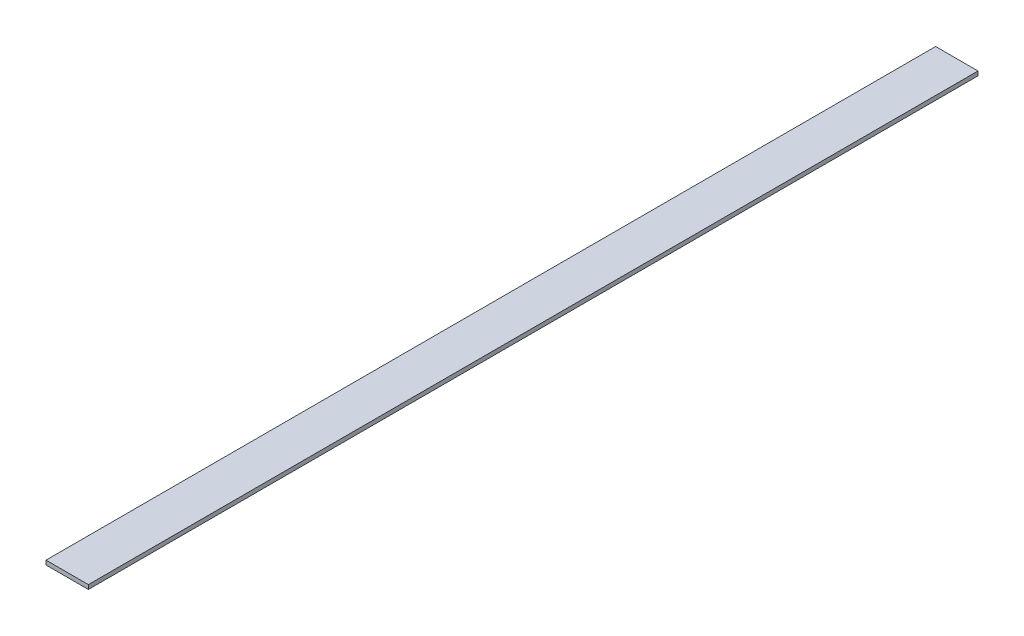
ISO-10303-21;
HEADER;
FILE_DESCRIPTION(('STEP AP214'),'2;1');
FILE_NAME('part.step','',(''),(''),'','','');
FILE_SCHEMA(('AUTOMOTIVE_DESIGN { 1 0 10303 214 1 1 1 1 }'));
ENDSEC;
DATA;
#1=APPLICATION_CONTEXT('core data for automotive mechanical design processes');
#2=APPLICATION_PROTOCOL_DEFINITION('international standard','automotive_design',2000,#1);
#3=PRODUCT_CONTEXT('',#1,'mechanical');
#4=PRODUCT('Part','Part','',(#3));
#5=PRODUCT_RELATED_PRODUCT_CATEGORY('part','',(#4));
#6=PRODUCT_DEFINITION_FORMATION('','',#4);
#7=PRODUCT_DEFINITION_CONTEXT('part definition',#1,'design');
#8=PRODUCT_DEFINITION('design','',#6,#7);
#9=PRODUCT_DEFINITION_SHAPE('','',#8);
#10=(LENGTH_UNIT() NAMED_UNIT(*) SI_UNIT(.MILLI.,.METRE.));
#11=(NAMED_UNIT(*) PLANE_ANGLE_UNIT() SI_UNIT($,.RADIAN.));
#12=(NAMED_UNIT(*) SI_UNIT($,.STERADIAN.) SOLID_ANGLE_UNIT());
#13=UNCERTAINTY_MEASURE_WITH_UNIT(LENGTH_MEASURE(1.E-05),#10,'distance_accuracy_value','');
#14=(GEOMETRIC_REPRESENTATION_CONTEXT(3) GLOBAL_UNCERTAINTY_ASSIGNED_CONTEXT((#13)) GLOBAL_UNIT_ASSIGNED_CONTEXT((#10,
#11,#12)) REPRESENTATION_CONTEXT('',''));
#15=CARTESIAN_POINT('',(0.,0.,0.));
#16=DIRECTION('',(0.,0.,1.));
#17=DIRECTION('',(1.,0.,0.));
#18=AXIS2_PLACEMENT_3D('',#15,#16,#17);
#19=CARTESIAN_POINT('',(-50.7999999999998,5.08,0.));
#20=DIRECTION('',(0.,0.,-1.));
#21=DIRECTION('',(-1.,0.,0.));
#22=AXIS2_PLACEMENT_3D('',#19,#20,#21);
#23=PLANE('',#22);
#24=DIRECTION('',(1.,0.,0.));
#25=VECTOR('',#24,1.);
#26=CARTESIAN_POINT('',(-50.7999999999998,0.,0.));
#27=LINE('',#26,#25);
#28=CARTESIAN_POINT('',(-50.7999999999998,0.,0.));
#29=VERTEX_POINT('',#28);
#30=CARTESIAN_POINT('',(0.,0.,0.));
#31=VERTEX_POINT('',#30);
#32=EDGE_CURVE('E111',#29,#31,#27,.T.);
#33=ORIENTED_EDGE('',*,*,#32,.T.);
#34=DIRECTION('',(0.,-1.,0.));
#35=VECTOR('',#34,1.);
#36=CARTESIAN_POINT('',(0.,5.08,0.));
#37=LINE('',#36,#35);
#38=CARTESIAN_POINT('',(0.,5.08,0.));
#39=VERTEX_POINT('',#38);
#40=EDGE_CURVE('E11',#39,#31,#37,.T.);
#41=ORIENTED_EDGE('',*,*,#40,.F.);
#42=DIRECTION('',(1.,0.,0.));
#43=VECTOR('',#42,1.);
#44=CARTESIAN_POINT('',(-50.7999999999998,5.08,0.));
#45=LINE('',#44,#43);
#46=CARTESIAN_POINT('',(-50.7999999999998,5.08,0.));
#47=VERTEX_POINT('',#46);
#48=EDGE_CURVE('E93',#47,#39,#45,.T.);
#49=ORIENTED_EDGE('',*,*,#48,.F.);
#50=DIRECTION('',(0.,-1.,0.));
#51=VECTOR('',#50,1.);
#52=CARTESIAN_POINT('',(-50.7999999999998,5.08,0.));
#53=LINE('',#52,#51);
#54=EDGE_CURVE('E107',#47,#29,#53,.T.);
#55=ORIENTED_EDGE('',*,*,#54,.T.);
#56=EDGE_LOOP('',(#33,#41,#49,#55));
#57=FACE_BOUND('',#56,.T.);
#58=ADVANCED_FACE('F41',(#57),#23,.F.);
#59=CARTESIAN_POINT('',(0.,5.08,0.));
#60=DIRECTION('',(-1.,0.,0.));
#61=DIRECTION('',(0.,0.,1.));
#62=AXIS2_PLACEMENT_3D('',#59,#60,#61);
#63=PLANE('',#62);
#64=DIRECTION('',(0.,0.,-1.));
#65=VECTOR('',#64,1.);
#66=CARTESIAN_POINT('',(0.,0.,0.));
#67=LINE('',#66,#65);
#68=CARTESIAN_POINT('',(0.,0.,-1066.8));
#69=VERTEX_POINT('',#68);
#70=EDGE_CURVE('E98',#31,#69,#67,.T.);
#71=ORIENTED_EDGE('',*,*,#70,.T.);
#72=DIRECTION('',(0.,-1.,0.));
#73=VECTOR('',#72,1.);
#74=CARTESIAN_POINT('',(0.,5.08,-1066.8));
#75=LINE('',#74,#73);
#76=CARTESIAN_POINT('',(0.,5.08,-1066.8));
#77=VERTEX_POINT('',#76);
#78=EDGE_CURVE('E50',#77,#69,#75,.T.);
#79=ORIENTED_EDGE('',*,*,#78,.F.);
#80=DIRECTION('',(0.,0.,-1.));
#81=VECTOR('',#80,1.);
#82=CARTESIAN_POINT('',(0.,5.08,0.));
#83=LINE('',#82,#81);
#84=EDGE_CURVE('E88',#39,#77,#83,.T.);
#85=ORIENTED_EDGE('',*,*,#84,.F.);
#86=ORIENTED_EDGE('',*,*,#40,.T.);
#87=EDGE_LOOP('',(#71,#79,#85,#86));
#88=FACE_BOUND('',#87,.T.);
#89=ADVANCED_FACE('F97',(#88),#63,.F.);
#90=CARTESIAN_POINT('',(0.,5.08,-1066.8));
#91=DIRECTION('',(0.,0.,1.));
#92=DIRECTION('',(1.,0.,0.));
#93=AXIS2_PLACEMENT_3D('',#90,#91,#92);
#94=PLANE('',#93);
#95=DIRECTION('',(-1.,0.,0.));
#96=VECTOR('',#95,1.);
#97=CARTESIAN_POINT('',(0.,0.,-1066.8));
#98=LINE('',#97,#96);
#99=CARTESIAN_POINT('',(-50.7999999999999,0.,-1066.8));
#100=VERTEX_POINT('',#99);
#101=EDGE_CURVE('E75',#69,#100,#98,.T.);
#102=ORIENTED_EDGE('',*,*,#101,.T.);
#103=DIRECTION('',(0.,-1.,0.));
#104=VECTOR('',#103,1.);
#105=CARTESIAN_POINT('',(-50.7999999999999,5.08,-1066.8));
#106=LINE('',#105,#104);
#107=CARTESIAN_POINT('',(-50.7999999999999,5.08,-1066.8));
#108=VERTEX_POINT('',#107);
#109=EDGE_CURVE('E100',#108,#100,#106,.T.);
#110=ORIENTED_EDGE('',*,*,#109,.F.);
#111=DIRECTION('',(-1.,0.,0.));
#112=VECTOR('',#111,1.);
#113=CARTESIAN_POINT('',(0.,5.08,-1066.8));
#114=LINE('',#113,#112);
#115=EDGE_CURVE('E91',#77,#108,#114,.T.);
#116=ORIENTED_EDGE('',*,*,#115,.F.);
#117=ORIENTED_EDGE('',*,*,#78,.T.);
#118=EDGE_LOOP('',(#102,#110,#116,#117));
#119=FACE_BOUND('',#118,.T.);
#120=ADVANCED_FACE('F101',(#119),#94,.F.);
#121=CARTESIAN_POINT('',(-50.7999999999999,5.08,-1066.8));
#122=DIRECTION('',(1.,0.,0.));
#123=DIRECTION('',(0.,0.,-1.));
#124=AXIS2_PLACEMENT_3D('',#121,#122,#123);
#125=PLANE('',#124);
#126=DIRECTION('',(0.,0.,1.));
#127=VECTOR('',#126,1.);
#128=CARTESIAN_POINT('',(-50.7999999999999,0.,-1066.8));
#129=LINE('',#128,#127);
#130=EDGE_CURVE('E81',#100,#29,#129,.T.);
#131=ORIENTED_EDGE('',*,*,#130,.T.);
#132=ORIENTED_EDGE('',*,*,#54,.F.);
#133=DIRECTION('',(0.,0.,1.));
#134=VECTOR('',#133,1.);
#135=CARTESIAN_POINT('',(-50.7999999999999,5.08,-1066.8));
#136=LINE('',#135,#134);
#137=EDGE_CURVE('E58',#108,#47,#136,.T.);
#138=ORIENTED_EDGE('',*,*,#137,.F.);
#139=ORIENTED_EDGE('',*,*,#109,.T.);
#140=EDGE_LOOP('',(#131,#132,#138,#139));
#141=FACE_BOUND('',#140,.T.);
#142=ADVANCED_FACE('F123',(#141),#125,.F.);
#143=CARTESIAN_POINT('',(0.,5.08,0.));
#144=DIRECTION('',(0.,1.,0.));
#145=DIRECTION('',(0.,0.,1.));
#146=AXIS2_PLACEMENT_3D('',#143,#144,#145);
#147=PLANE('',#146);
#148=ORIENTED_EDGE('',*,*,#48,.T.);
#149=ORIENTED_EDGE('',*,*,#84,.T.);
#150=ORIENTED_EDGE('',*,*,#115,.T.);
#151=ORIENTED_EDGE('',*,*,#137,.T.);
#152=EDGE_LOOP('',(#148,#149,#150,#151));
#153=FACE_BOUND('',#152,.T.);
#154=ADVANCED_FACE('F89',(#153),#147,.T.);
#155=CARTESIAN_POINT('',(0.,0.,0.));
#156=DIRECTION('',(0.,1.,0.));
#157=DIRECTION('',(0.,0.,1.));
#158=AXIS2_PLACEMENT_3D('',#155,#156,#157);
#159=PLANE('',#158);
#160=ORIENTED_EDGE('',*,*,#32,.F.);
#161=ORIENTED_EDGE('',*,*,#130,.F.);
#162=ORIENTED_EDGE('',*,*,#101,.F.);
#163=ORIENTED_EDGE('',*,*,#70,.F.);
#164=EDGE_LOOP('',(#160,#161,#162,#163));
#165=FACE_BOUND('',#164,.T.);
#166=ADVANCED_FACE('F126',(#165),#159,.F.);
#167=CLOSED_SHELL('',(#58,#89,#120,#142,#154,#166));
#168=MANIFOLD_SOLID_BREP('B2',#167);
#169=ADVANCED_BREP_SHAPE_REPRESENTATION('',(#18,#168),#14);
#170=SHAPE_DEFINITION_REPRESENTATION(#9,#169);
ENDSEC;
END-ISO-10303-21;
